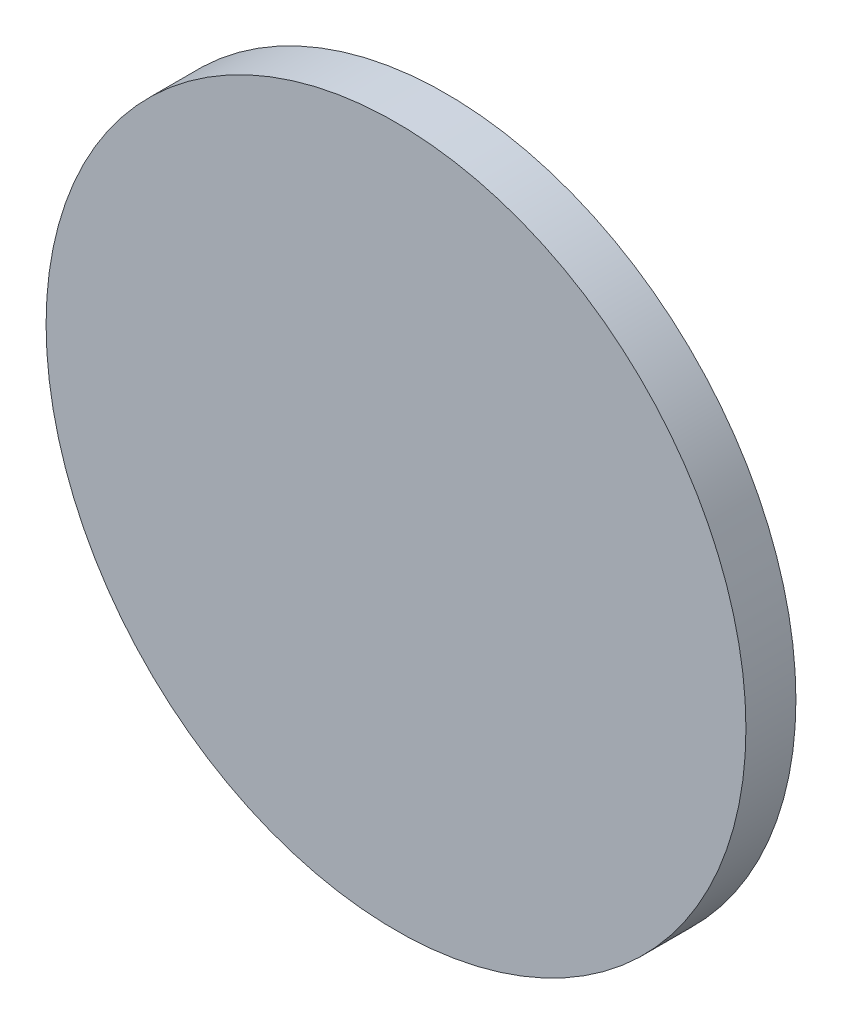
ISO-10303-21;
HEADER;
FILE_DESCRIPTION(('STEP AP214'),'2;1');
FILE_NAME('part.step','',(''),(''),'','','');
FILE_SCHEMA(('AUTOMOTIVE_DESIGN { 1 0 10303 214 1 1 1 1 }'));
ENDSEC;
DATA;
#1=APPLICATION_CONTEXT('core data for automotive mechanical design processes');
#2=APPLICATION_PROTOCOL_DEFINITION('international standard','automotive_design',2000,#1);
#3=PRODUCT_CONTEXT('',#1,'mechanical');
#4=PRODUCT('Part','Part','',(#3));
#5=PRODUCT_RELATED_PRODUCT_CATEGORY('part','',(#4));
#6=PRODUCT_DEFINITION_FORMATION('','',#4);
#7=PRODUCT_DEFINITION_CONTEXT('part definition',#1,'design');
#8=PRODUCT_DEFINITION('design','',#6,#7);
#9=PRODUCT_DEFINITION_SHAPE('','',#8);
#10=(LENGTH_UNIT() NAMED_UNIT(*) SI_UNIT(.MILLI.,.METRE.));
#11=(NAMED_UNIT(*) PLANE_ANGLE_UNIT() SI_UNIT($,.RADIAN.));
#12=(NAMED_UNIT(*) SI_UNIT($,.STERADIAN.) SOLID_ANGLE_UNIT());
#13=UNCERTAINTY_MEASURE_WITH_UNIT(LENGTH_MEASURE(1.E-05),#10,'distance_accuracy_value','');
#14=(GEOMETRIC_REPRESENTATION_CONTEXT(3) GLOBAL_UNCERTAINTY_ASSIGNED_CONTEXT((#13)) GLOBAL_UNIT_ASSIGNED_CONTEXT((#10,
#11,#12)) REPRESENTATION_CONTEXT('',''));
#15=CARTESIAN_POINT('',(0.,0.,0.));
#16=DIRECTION('',(0.,0.,1.));
#17=DIRECTION('',(1.,0.,0.));
#18=AXIS2_PLACEMENT_3D('',#15,#16,#17);
#19=CARTESIAN_POINT('',(0.,0.,0.1499997));
#20=DIRECTION('',(0.,0.,1.));
#21=DIRECTION('',(1.,0.,0.));
#22=AXIS2_PLACEMENT_3D('',#19,#20,#21);
#23=PLANE('',#22);
#24=CARTESIAN_POINT('',(0.,0.,0.1499997));
#25=DIRECTION('',(0.,0.,1.));
#26=DIRECTION('',(1.,0.,0.));
#27=AXIS2_PLACEMENT_3D('',#24,#25,#26);
#28=CIRCLE('',#27,1.05000044);
#29=CARTESIAN_POINT('',(-1.05000044,0.,0.1499997));
#30=VERTEX_POINT('',#29);
#31=EDGE_CURVE('E11',#30,#30,#28,.T.);
#32=ORIENTED_EDGE('',*,*,#31,.T.);
#33=EDGE_LOOP('',(#32));
#34=FACE_BOUND('',#33,.T.);
#35=ADVANCED_FACE('F16',(#34),#23,.T.);
#36=CARTESIAN_POINT('',(0.,0.,0.));
#37=DIRECTION('',(0.,0.,1.));
#38=DIRECTION('',(1.,0.,0.));
#39=AXIS2_PLACEMENT_3D('',#36,#37,#38);
#40=PLANE('',#39);
#41=CARTESIAN_POINT('',(0.,0.,0.));
#42=DIRECTION('',(0.,0.,1.));
#43=DIRECTION('',(1.,0.,0.));
#44=AXIS2_PLACEMENT_3D('',#41,#42,#43);
#45=CIRCLE('',#44,1.05000044);
#46=CARTESIAN_POINT('',(-1.05000044,0.,0.));
#47=VERTEX_POINT('',#46);
#48=EDGE_CURVE('E20',#47,#47,#45,.T.);
#49=ORIENTED_EDGE('',*,*,#48,.F.);
#50=EDGE_LOOP('',(#49));
#51=FACE_BOUND('',#50,.T.);
#52=ADVANCED_FACE('F61',(#51),#40,.F.);
#53=CARTESIAN_POINT('',(0.,0.,0.));
#54=DIRECTION('',(0.,0.,-1.));
#55=DIRECTION('',(1.,0.,0.));
#56=AXIS2_PLACEMENT_3D('',#53,#54,#55);
#57=CYLINDRICAL_SURFACE('',#56,1.05000044);
#58=ORIENTED_EDGE('',*,*,#48,.T.);
#59=DIRECTION('',(0.,0.,1.));
#60=VECTOR('',#59,1.);
#61=CARTESIAN_POINT('',(-1.05000044,0.,0.));
#62=LINE('',#61,#60);
#63=EDGE_CURVE('E26',#47,#30,#62,.T.);
#64=ORIENTED_EDGE('',*,*,#63,.T.);
#65=ORIENTED_EDGE('',*,*,#31,.F.);
#66=ORIENTED_EDGE('',*,*,#63,.F.);
#67=EDGE_LOOP('',(#58,#64,#65,#66));
#68=FACE_BOUND('',#67,.T.);
#69=ADVANCED_FACE('F18',(#68),#57,.T.);
#70=CLOSED_SHELL('',(#35,#52,#69));
#71=MANIFOLD_SOLID_BREP('B1',#70);
#72=ADVANCED_BREP_SHAPE_REPRESENTATION('',(#18,#71),#14);
#73=SHAPE_DEFINITION_REPRESENTATION(#9,#72);
ENDSEC;
END-ISO-10303-21;
